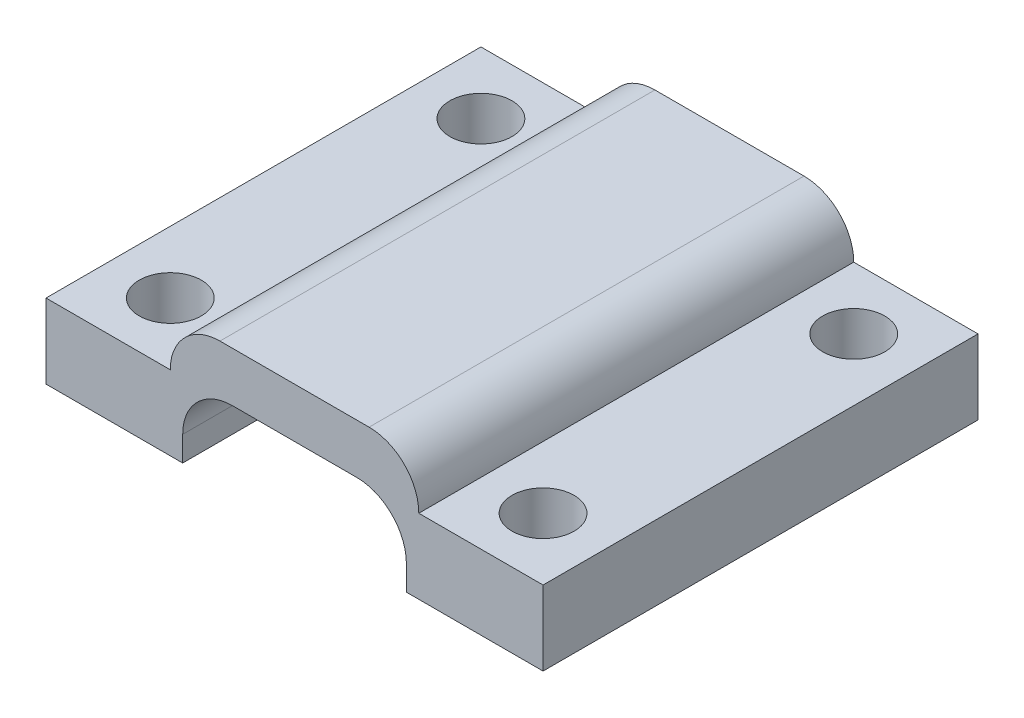
ISO-10303-21;
HEADER;
FILE_DESCRIPTION(('STEP AP214'),'2;1');
FILE_NAME('part.step','',(''),(''),'','','');
FILE_SCHEMA(('AUTOMOTIVE_DESIGN { 1 0 10303 214 1 1 1 1 }'));
ENDSEC;
DATA;
#1=APPLICATION_CONTEXT('core data for automotive mechanical design processes');
#2=APPLICATION_PROTOCOL_DEFINITION('international standard','automotive_design',2000,#1);
#3=PRODUCT_CONTEXT('',#1,'mechanical');
#4=PRODUCT('Part','Part','',(#3));
#5=PRODUCT_RELATED_PRODUCT_CATEGORY('part','',(#4));
#6=PRODUCT_DEFINITION_FORMATION('','',#4);
#7=PRODUCT_DEFINITION_CONTEXT('part definition',#1,'design');
#8=PRODUCT_DEFINITION('design','',#6,#7);
#9=PRODUCT_DEFINITION_SHAPE('','',#8);
#10=(LENGTH_UNIT() NAMED_UNIT(*) SI_UNIT(.MILLI.,.METRE.));
#11=(NAMED_UNIT(*) PLANE_ANGLE_UNIT() SI_UNIT($,.RADIAN.));
#12=(NAMED_UNIT(*) SI_UNIT($,.STERADIAN.) SOLID_ANGLE_UNIT());
#13=UNCERTAINTY_MEASURE_WITH_UNIT(LENGTH_MEASURE(1.E-05),#10,'distance_accuracy_value','');
#14=(GEOMETRIC_REPRESENTATION_CONTEXT(3) GLOBAL_UNCERTAINTY_ASSIGNED_CONTEXT((#13)) GLOBAL_UNIT_ASSIGNED_CONTEXT((#10,
#11,#12)) REPRESENTATION_CONTEXT('',''));
#15=CARTESIAN_POINT('',(0.,0.,0.));
#16=DIRECTION('',(0.,0.,1.));
#17=DIRECTION('',(1.,0.,0.));
#18=AXIS2_PLACEMENT_3D('',#15,#16,#17);
#19=CARTESIAN_POINT('',(0.,0.,0.));
#20=DIRECTION('',(0.,1.,0.));
#21=DIRECTION('',(0.,0.,1.));
#22=AXIS2_PLACEMENT_3D('',#19,#20,#21);
#23=PLANE('',#22);
#24=CARTESIAN_POINT('',(-7.21354166666667,0.,21.6145833333333));
#25=DIRECTION('',(0.,1.,0.));
#26=DIRECTION('',(0.,0.,1.));
#27=AXIS2_PLACEMENT_3D('',#24,#25,#26);
#28=CIRCLE('',#27,2.5);
#29=CARTESIAN_POINT('',(-7.21354166666667,0.,24.1145833333333));
#30=VERTEX_POINT('',#29);
#31=EDGE_CURVE('E253',#30,#30,#28,.T.);
#32=ORIENTED_EDGE('',*,*,#31,.T.);
#33=EDGE_LOOP('',(#32));
#34=FACE_BOUND('',#33,.T.);
#35=CARTESIAN_POINT('',(-7.21354166666668,0.,-3.38541666666667));
#36=DIRECTION('',(0.,1.,0.));
#37=DIRECTION('',(0.,0.,1.));
#38=AXIS2_PLACEMENT_3D('',#35,#36,#37);
#39=CIRCLE('',#38,2.5);
#40=CARTESIAN_POINT('',(-7.21354166666668,0.,-0.885416666666669));
#41=VERTEX_POINT('',#40);
#42=EDGE_CURVE('E247',#41,#41,#39,.T.);
#43=ORIENTED_EDGE('',*,*,#42,.T.);
#44=EDGE_LOOP('',(#43));
#45=FACE_BOUND('',#44,.T.);
#46=DIRECTION('',(-1.,0.,0.));
#47=VECTOR('',#46,1.);
#48=CARTESIAN_POINT('',(-12.2135416666667,0.,-8.38541666666667));
#49=LINE('',#48,#47);
#50=CARTESIAN_POINT('',(-1.21354166666667,0.,-8.38541666666667));
#51=VERTEX_POINT('',#50);
#52=CARTESIAN_POINT('',(-12.2135416666667,0.,-8.38541666666667));
#53=VERTEX_POINT('',#52);
#54=EDGE_CURVE('E139',#51,#53,#49,.T.);
#55=ORIENTED_EDGE('',*,*,#54,.F.);
#56=DIRECTION('',(0.,0.,-1.));
#57=VECTOR('',#56,1.);
#58=CARTESIAN_POINT('',(-1.21354166666668,0.,26.6145833333333));
#59=LINE('',#58,#57);
#60=CARTESIAN_POINT('',(-1.21354166666668,0.,26.6145833333333));
#61=VERTEX_POINT('',#60);
#62=EDGE_CURVE('E149',#61,#51,#59,.T.);
#63=ORIENTED_EDGE('',*,*,#62,.F.);
#64=DIRECTION('',(1.,0.,0.));
#65=VECTOR('',#64,1.);
#66=CARTESIAN_POINT('',(-12.2135416666667,0.,26.6145833333333));
#67=LINE('',#66,#65);
#68=CARTESIAN_POINT('',(-12.2135416666667,0.,26.6145833333333));
#69=VERTEX_POINT('',#68);
#70=EDGE_CURVE('E165',#69,#61,#67,.T.);
#71=ORIENTED_EDGE('',*,*,#70,.F.);
#72=DIRECTION('',(0.,0.,1.));
#73=VECTOR('',#72,1.);
#74=CARTESIAN_POINT('',(-12.2135416666667,0.,-8.38541666666667));
#75=LINE('',#74,#73);
#76=EDGE_CURVE('E159',#53,#69,#75,.T.);
#77=ORIENTED_EDGE('',*,*,#76,.F.);
#78=EDGE_LOOP('',(#55,#63,#71,#77));
#79=FACE_BOUND('',#78,.T.);
#80=ADVANCED_FACE('F33',(#34,#45,#79),#23,.F.);
#81=CARTESIAN_POINT('',(0.,6.,0.));
#82=DIRECTION('',(0.,1.,0.));
#83=DIRECTION('',(0.,0.,1.));
#84=AXIS2_PLACEMENT_3D('',#81,#82,#83);
#85=PLANE('',#84);
#86=DIRECTION('',(0.,0.,1.));
#87=VECTOR('',#86,1.);
#88=CARTESIAN_POINT('',(-2.21354166666668,6.,-8.38541666666667));
#89=LINE('',#88,#87);
#90=CARTESIAN_POINT('',(-2.21354166666667,6.,-8.38541666666667));
#91=VERTEX_POINT('',#90);
#92=CARTESIAN_POINT('',(-2.21354166666667,6.,26.6145833333333));
#93=VERTEX_POINT('',#92);
#94=EDGE_CURVE('E219',#91,#93,#89,.T.);
#95=ORIENTED_EDGE('',*,*,#94,.F.);
#96=DIRECTION('',(-1.,0.,0.));
#97=VECTOR('',#96,1.);
#98=CARTESIAN_POINT('',(-12.2135416666667,6.,-8.38541666666667));
#99=LINE('',#98,#97);
#100=CARTESIAN_POINT('',(-12.2135416666667,6.,-8.38541666666667));
#101=VERTEX_POINT('',#100);
#102=EDGE_CURVE('E260',#91,#101,#99,.T.);
#103=ORIENTED_EDGE('',*,*,#102,.T.);
#104=DIRECTION('',(0.,0.,1.));
#105=VECTOR('',#104,1.);
#106=CARTESIAN_POINT('',(-12.2135416666667,6.,-8.38541666666667));
#107=LINE('',#106,#105);
#108=CARTESIAN_POINT('',(-12.2135416666667,6.,26.6145833333333));
#109=VERTEX_POINT('',#108);
#110=EDGE_CURVE('E164',#101,#109,#107,.T.);
#111=ORIENTED_EDGE('',*,*,#110,.T.);
#112=DIRECTION('',(1.,0.,0.));
#113=VECTOR('',#112,1.);
#114=CARTESIAN_POINT('',(-12.2135416666667,6.,26.6145833333333));
#115=LINE('',#114,#113);
#116=EDGE_CURVE('E209',#109,#93,#115,.T.);
#117=ORIENTED_EDGE('',*,*,#116,.T.);
#118=EDGE_LOOP('',(#95,#103,#111,#117));
#119=FACE_BOUND('',#118,.T.);
#120=CARTESIAN_POINT('',(-7.21354166666667,6.,21.6145833333333));
#121=DIRECTION('',(0.,1.,0.));
#122=DIRECTION('',(0.,0.,1.));
#123=AXIS2_PLACEMENT_3D('',#120,#121,#122);
#124=CIRCLE('',#123,2.5);
#125=CARTESIAN_POINT('',(-7.21354166666667,6.,24.1145833333333));
#126=VERTEX_POINT('',#125);
#127=EDGE_CURVE('E237',#126,#126,#124,.T.);
#128=ORIENTED_EDGE('',*,*,#127,.F.);
#129=EDGE_LOOP('',(#128));
#130=FACE_BOUND('',#129,.T.);
#131=CARTESIAN_POINT('',(-7.21354166666668,6.,-3.38541666666667));
#132=DIRECTION('',(0.,1.,0.));
#133=DIRECTION('',(0.,0.,1.));
#134=AXIS2_PLACEMENT_3D('',#131,#132,#133);
#135=CIRCLE('',#134,2.5);
#136=CARTESIAN_POINT('',(-7.21354166666668,6.,-0.885416666666669));
#137=VERTEX_POINT('',#136);
#138=EDGE_CURVE('E250',#137,#137,#135,.T.);
#139=ORIENTED_EDGE('',*,*,#138,.F.);
#140=EDGE_LOOP('',(#139));
#141=FACE_BOUND('',#140,.T.);
#142=ADVANCED_FACE('F217',(#119,#130,#141),#85,.T.);
#143=CARTESIAN_POINT('',(-12.2135416666667,6.,-8.38541666666667));
#144=DIRECTION('',(1.,0.,0.));
#145=DIRECTION('',(0.,0.,-1.));
#146=AXIS2_PLACEMENT_3D('',#143,#144,#145);
#147=PLANE('',#146);
#148=ORIENTED_EDGE('',*,*,#76,.T.);
#149=DIRECTION('',(0.,-1.,0.));
#150=VECTOR('',#149,1.);
#151=CARTESIAN_POINT('',(-12.2135416666667,6.,26.6145833333333));
#152=LINE('',#151,#150);
#153=EDGE_CURVE('E178',#109,#69,#152,.T.);
#154=ORIENTED_EDGE('',*,*,#153,.F.);
#155=ORIENTED_EDGE('',*,*,#110,.F.);
#156=DIRECTION('',(0.,-1.,0.));
#157=VECTOR('',#156,1.);
#158=CARTESIAN_POINT('',(-12.2135416666667,6.,-8.38541666666667));
#159=LINE('',#158,#157);
#160=EDGE_CURVE('E169',#101,#53,#159,.T.);
#161=ORIENTED_EDGE('',*,*,#160,.T.);
#162=EDGE_LOOP('',(#148,#154,#155,#161));
#163=FACE_BOUND('',#162,.T.);
#164=ADVANCED_FACE('F319',(#163),#147,.F.);
#165=CARTESIAN_POINT('',(-12.2135416666667,6.,26.6145833333333));
#166=DIRECTION('',(0.,0.,-1.));
#167=DIRECTION('',(-1.,0.,0.));
#168=AXIS2_PLACEMENT_3D('',#165,#166,#167);
#169=PLANE('',#168);
#170=CARTESIAN_POINT('',(17.7864583333333,6.,26.6145833333333));
#171=VERTEX_POINT('',#170);
#172=CARTESIAN_POINT('',(27.7864583333333,6.,26.6145833333333));
#173=VERTEX_POINT('',#172);
#174=EDGE_CURVE('E223',#171,#173,#115,.T.);
#175=ORIENTED_EDGE('',*,*,#174,.F.);
#176=CARTESIAN_POINT('',(13.7864583333333,6.,26.6145833333333));
#177=DIRECTION('',(0.,0.,-1.));
#178=DIRECTION('',(-1.,0.,0.));
#179=AXIS2_PLACEMENT_3D('',#176,#177,#178);
#180=CIRCLE('',#179,4.);
#181=CARTESIAN_POINT('',(13.7864583333333,10.,26.6145833333333));
#182=VERTEX_POINT('',#181);
#183=EDGE_CURVE('E11',#171,#182,#180,.F.);
#184=ORIENTED_EDGE('',*,*,#183,.T.);
#185=DIRECTION('',(1.,0.,0.));
#186=VECTOR('',#185,1.);
#187=CARTESIAN_POINT('',(-2.21354166666667,10.,26.6145833333333));
#188=LINE('',#187,#186);
#189=CARTESIAN_POINT('',(1.78645833333333,10.,26.6145833333333));
#190=VERTEX_POINT('',#189);
#191=EDGE_CURVE('E212',#190,#182,#188,.T.);
#192=ORIENTED_EDGE('',*,*,#191,.F.);
#193=CARTESIAN_POINT('',(1.78645833333333,6.,26.6145833333333));
#194=DIRECTION('',(0.,0.,-1.));
#195=DIRECTION('',(-1.,0.,0.));
#196=AXIS2_PLACEMENT_3D('',#193,#194,#195);
#197=CIRCLE('',#196,4.);
#198=EDGE_CURVE('E41',#190,#93,#197,.F.);
#199=ORIENTED_EDGE('',*,*,#198,.T.);
#200=ORIENTED_EDGE('',*,*,#116,.F.);
#201=ORIENTED_EDGE('',*,*,#153,.T.);
#202=ORIENTED_EDGE('',*,*,#70,.T.);
#203=DIRECTION('',(0.,-1.,0.));
#204=VECTOR('',#203,1.);
#205=CARTESIAN_POINT('',(-1.21354166666668,6.,26.6145833333333));
#206=LINE('',#205,#204);
#207=CARTESIAN_POINT('',(-1.21354166666668,2.,26.6145833333333));
#208=VERTEX_POINT('',#207);
#209=EDGE_CURVE('E152',#208,#61,#206,.T.);
#210=ORIENTED_EDGE('',*,*,#209,.F.);
#211=CARTESIAN_POINT('',(2.78645833333332,2.,26.6145833333333));
#212=DIRECTION('',(0.,0.,-1.));
#213=DIRECTION('',(-1.,0.,0.));
#214=AXIS2_PLACEMENT_3D('',#211,#212,#213);
#215=CIRCLE('',#214,4.);
#216=CARTESIAN_POINT('',(2.78645833333332,6.,26.6145833333333));
#217=VERTEX_POINT('',#216);
#218=EDGE_CURVE('E196',#208,#217,#215,.T.);
#219=ORIENTED_EDGE('',*,*,#218,.T.);
#220=DIRECTION('',(-1.,0.,0.));
#221=VECTOR('',#220,1.);
#222=CARTESIAN_POINT('',(-1.21354166666668,6.,26.6145833333333));
#223=LINE('',#222,#221);
#224=CARTESIAN_POINT('',(12.7864583333333,6.,26.6145833333333));
#225=VERTEX_POINT('',#224);
#226=EDGE_CURVE('E146',#225,#217,#223,.T.);
#227=ORIENTED_EDGE('',*,*,#226,.F.);
#228=CARTESIAN_POINT('',(12.7864583333333,2.,26.6145833333333));
#229=DIRECTION('',(0.,0.,-1.));
#230=DIRECTION('',(-1.,0.,0.));
#231=AXIS2_PLACEMENT_3D('',#228,#229,#230);
#232=CIRCLE('',#231,4.);
#233=CARTESIAN_POINT('',(16.7864583333333,2.,26.6145833333333));
#234=VERTEX_POINT('',#233);
#235=EDGE_CURVE('E191',#225,#234,#232,.T.);
#236=ORIENTED_EDGE('',*,*,#235,.T.);
#237=DIRECTION('',(0.,-1.,0.));
#238=VECTOR('',#237,1.);
#239=CARTESIAN_POINT('',(16.7864583333333,6.,26.6145833333333));
#240=LINE('',#239,#238);
#241=CARTESIAN_POINT('',(16.7864583333333,0.,26.6145833333333));
#242=VERTEX_POINT('',#241);
#243=EDGE_CURVE('E228',#234,#242,#240,.T.);
#244=ORIENTED_EDGE('',*,*,#243,.T.);
#245=CARTESIAN_POINT('',(27.7864583333333,0.,26.6145833333333));
#246=VERTEX_POINT('',#245);
#247=EDGE_CURVE('E263',#242,#246,#67,.T.);
#248=ORIENTED_EDGE('',*,*,#247,.T.);
#249=DIRECTION('',(0.,-1.,0.));
#250=VECTOR('',#249,1.);
#251=CARTESIAN_POINT('',(27.7864583333333,6.,26.6145833333333));
#252=LINE('',#251,#250);
#253=EDGE_CURVE('E175',#173,#246,#252,.T.);
#254=ORIENTED_EDGE('',*,*,#253,.F.);
#255=EDGE_LOOP('',(#175,#184,#192,#199,#200,#201,#202,#210,#219,#227,#236,#244,#248,#254));
#256=FACE_BOUND('',#255,.T.);
#257=ADVANCED_FACE('F208',(#256),#169,.F.);
#258=CARTESIAN_POINT('',(27.7864583333333,6.,-8.38541666666667));
#259=DIRECTION('',(-1.,0.,0.));
#260=DIRECTION('',(0.,0.,1.));
#261=AXIS2_PLACEMENT_3D('',#258,#259,#260);
#262=PLANE('',#261);
#263=DIRECTION('',(0.,0.,-1.));
#264=VECTOR('',#263,1.);
#265=CARTESIAN_POINT('',(27.7864583333333,0.,-8.38541666666667));
#266=LINE('',#265,#264);
#267=CARTESIAN_POINT('',(27.7864583333333,0.,-8.38541666666667));
#268=VERTEX_POINT('',#267);
#269=EDGE_CURVE('E161',#246,#268,#266,.T.);
#270=ORIENTED_EDGE('',*,*,#269,.T.);
#271=DIRECTION('',(0.,-1.,0.));
#272=VECTOR('',#271,1.);
#273=CARTESIAN_POINT('',(27.7864583333333,6.,-8.38541666666667));
#274=LINE('',#273,#272);
#275=CARTESIAN_POINT('',(27.7864583333333,6.,-8.38541666666667));
#276=VERTEX_POINT('',#275);
#277=EDGE_CURVE('E171',#276,#268,#274,.T.);
#278=ORIENTED_EDGE('',*,*,#277,.F.);
#279=DIRECTION('',(0.,0.,-1.));
#280=VECTOR('',#279,1.);
#281=CARTESIAN_POINT('',(27.7864583333333,6.,-8.38541666666667));
#282=LINE('',#281,#280);
#283=EDGE_CURVE('E222',#173,#276,#282,.T.);
#284=ORIENTED_EDGE('',*,*,#283,.F.);
#285=ORIENTED_EDGE('',*,*,#253,.T.);
#286=EDGE_LOOP('',(#270,#278,#284,#285));
#287=FACE_BOUND('',#286,.T.);
#288=ADVANCED_FACE('F273',(#287),#262,.F.);
#289=CARTESIAN_POINT('',(-12.2135416666667,6.,-8.38541666666667));
#290=DIRECTION('',(0.,0.,1.));
#291=DIRECTION('',(1.,0.,0.));
#292=AXIS2_PLACEMENT_3D('',#289,#290,#291);
#293=PLANE('',#292);
#294=DIRECTION('',(-1.,0.,0.));
#295=VECTOR('',#294,1.);
#296=CARTESIAN_POINT('',(-2.21354166666668,10.,-8.38541666666667));
#297=LINE('',#296,#295);
#298=CARTESIAN_POINT('',(13.7864583333333,10.,-8.38541666666667));
#299=VERTEX_POINT('',#298);
#300=CARTESIAN_POINT('',(1.78645833333332,10.,-8.38541666666667));
#301=VERTEX_POINT('',#300);
#302=EDGE_CURVE('E231',#299,#301,#297,.T.);
#303=ORIENTED_EDGE('',*,*,#302,.F.);
#304=CARTESIAN_POINT('',(13.7864583333333,6.,-8.38541666666667));
#305=DIRECTION('',(0.,0.,1.));
#306=DIRECTION('',(1.,0.,0.));
#307=AXIS2_PLACEMENT_3D('',#304,#305,#306);
#308=CIRCLE('',#307,4.);
#309=CARTESIAN_POINT('',(17.7864583333333,6.,-8.38541666666667));
#310=VERTEX_POINT('',#309);
#311=EDGE_CURVE('E56',#299,#310,#308,.F.);
#312=ORIENTED_EDGE('',*,*,#311,.T.);
#313=EDGE_CURVE('E172',#276,#310,#99,.T.);
#314=ORIENTED_EDGE('',*,*,#313,.F.);
#315=ORIENTED_EDGE('',*,*,#277,.T.);
#316=CARTESIAN_POINT('',(16.7864583333333,0.,-8.38541666666667));
#317=VERTEX_POINT('',#316);
#318=EDGE_CURVE('E160',#268,#317,#49,.T.);
#319=ORIENTED_EDGE('',*,*,#318,.T.);
#320=DIRECTION('',(0.,-1.,0.));
#321=VECTOR('',#320,1.);
#322=CARTESIAN_POINT('',(16.7864583333333,6.,-8.38541666666667));
#323=LINE('',#322,#321);
#324=CARTESIAN_POINT('',(16.7864583333333,2.,-8.38541666666667));
#325=VERTEX_POINT('',#324);
#326=EDGE_CURVE('E145',#325,#317,#323,.T.);
#327=ORIENTED_EDGE('',*,*,#326,.F.);
#328=CARTESIAN_POINT('',(12.7864583333333,2.,-8.38541666666667));
#329=DIRECTION('',(0.,0.,1.));
#330=DIRECTION('',(1.,0.,0.));
#331=AXIS2_PLACEMENT_3D('',#328,#329,#330);
#332=CIRCLE('',#331,4.);
#333=CARTESIAN_POINT('',(12.7864583333333,6.,-8.38541666666667));
#334=VERTEX_POINT('',#333);
#335=EDGE_CURVE('E193',#325,#334,#332,.T.);
#336=ORIENTED_EDGE('',*,*,#335,.T.);
#337=DIRECTION('',(1.,0.,0.));
#338=VECTOR('',#337,1.);
#339=CARTESIAN_POINT('',(-1.21354166666667,6.,-8.38541666666667));
#340=LINE('',#339,#338);
#341=CARTESIAN_POINT('',(2.78645833333333,6.,-8.38541666666667));
#342=VERTEX_POINT('',#341);
#343=EDGE_CURVE('E290',#342,#334,#340,.T.);
#344=ORIENTED_EDGE('',*,*,#343,.F.);
#345=CARTESIAN_POINT('',(2.78645833333333,2.,-8.38541666666667));
#346=DIRECTION('',(0.,0.,1.));
#347=DIRECTION('',(1.,0.,0.));
#348=AXIS2_PLACEMENT_3D('',#345,#346,#347);
#349=CIRCLE('',#348,4.);
#350=CARTESIAN_POINT('',(-1.21354166666667,2.,-8.38541666666667));
#351=VERTEX_POINT('',#350);
#352=EDGE_CURVE('E142',#342,#351,#349,.T.);
#353=ORIENTED_EDGE('',*,*,#352,.T.);
#354=DIRECTION('',(0.,-1.,0.));
#355=VECTOR('',#354,1.);
#356=CARTESIAN_POINT('',(-1.21354166666667,6.,-8.38541666666667));
#357=LINE('',#356,#355);
#358=EDGE_CURVE('E134',#351,#51,#357,.T.);
#359=ORIENTED_EDGE('',*,*,#358,.T.);
#360=ORIENTED_EDGE('',*,*,#54,.T.);
#361=ORIENTED_EDGE('',*,*,#160,.F.);
#362=ORIENTED_EDGE('',*,*,#102,.F.);
#363=CARTESIAN_POINT('',(1.78645833333332,6.,-8.38541666666667));
#364=DIRECTION('',(0.,0.,1.));
#365=DIRECTION('',(1.,0.,0.));
#366=AXIS2_PLACEMENT_3D('',#363,#364,#365);
#367=CIRCLE('',#366,4.);
#368=EDGE_CURVE('E48',#91,#301,#367,.F.);
#369=ORIENTED_EDGE('',*,*,#368,.T.);
#370=EDGE_LOOP('',(#303,#312,#314,#315,#319,#327,#336,#344,#353,#359,#360,#361,#362,#369));
#371=FACE_BOUND('',#370,.T.);
#372=ADVANCED_FACE('F136',(#371),#293,.F.);
#373=DIRECTION('',(0.,0.,-1.));
#374=VECTOR('',#373,1.);
#375=CARTESIAN_POINT('',(17.7864583333333,6.,-8.38541666666667));
#376=LINE('',#375,#374);
#377=EDGE_CURVE('E225',#171,#310,#376,.T.);
#378=ORIENTED_EDGE('',*,*,#377,.F.);
#379=ORIENTED_EDGE('',*,*,#174,.T.);
#380=ORIENTED_EDGE('',*,*,#283,.T.);
#381=ORIENTED_EDGE('',*,*,#313,.T.);
#382=EDGE_LOOP('',(#378,#379,#380,#381));
#383=FACE_BOUND('',#382,.T.);
#384=CARTESIAN_POINT('',(22.7864583333333,6.,21.6145833333333));
#385=DIRECTION('',(0.,1.,0.));
#386=DIRECTION('',(0.,0.,1.));
#387=AXIS2_PLACEMENT_3D('',#384,#385,#386);
#388=CIRCLE('',#387,2.5);
#389=CARTESIAN_POINT('',(22.7864583333333,6.,24.1145833333333));
#390=VERTEX_POINT('',#389);
#391=EDGE_CURVE('E244',#390,#390,#388,.T.);
#392=ORIENTED_EDGE('',*,*,#391,.F.);
#393=EDGE_LOOP('',(#392));
#394=FACE_BOUND('',#393,.T.);
#395=CARTESIAN_POINT('',(22.7864583333333,6.,-3.38541666666667));
#396=DIRECTION('',(0.,1.,0.));
#397=DIRECTION('',(0.,0.,1.));
#398=AXIS2_PLACEMENT_3D('',#395,#396,#397);
#399=CIRCLE('',#398,2.5);
#400=CARTESIAN_POINT('',(22.7864583333333,6.,-0.885416666666669));
#401=VERTEX_POINT('',#400);
#402=EDGE_CURVE('E238',#401,#401,#399,.T.);
#403=ORIENTED_EDGE('',*,*,#402,.F.);
#404=EDGE_LOOP('',(#403));
#405=FACE_BOUND('',#404,.T.);
#406=ADVANCED_FACE('F281',(#383,#394,#405),#85,.T.);
#407=CARTESIAN_POINT('',(22.7864583333333,0.,21.6145833333333));
#408=DIRECTION('',(0.,1.,0.));
#409=DIRECTION('',(0.,0.,1.));
#410=AXIS2_PLACEMENT_3D('',#407,#408,#409);
#411=CIRCLE('',#410,2.5);
#412=CARTESIAN_POINT('',(22.7864583333333,0.,24.1145833333333));
#413=VERTEX_POINT('',#412);
#414=EDGE_CURVE('E241',#413,#413,#411,.T.);
#415=ORIENTED_EDGE('',*,*,#414,.T.);
#416=EDGE_LOOP('',(#415));
#417=FACE_BOUND('',#416,.T.);
#418=CARTESIAN_POINT('',(22.7864583333333,0.,-3.38541666666667));
#419=DIRECTION('',(0.,1.,0.));
#420=DIRECTION('',(0.,0.,1.));
#421=AXIS2_PLACEMENT_3D('',#418,#419,#420);
#422=CIRCLE('',#421,2.5);
#423=CARTESIAN_POINT('',(22.7864583333333,0.,-0.885416666666669));
#424=VERTEX_POINT('',#423);
#425=EDGE_CURVE('E234',#424,#424,#422,.T.);
#426=ORIENTED_EDGE('',*,*,#425,.T.);
#427=EDGE_LOOP('',(#426));
#428=FACE_BOUND('',#427,.T.);
#429=ORIENTED_EDGE('',*,*,#247,.F.);
#430=DIRECTION('',(0.,0.,1.));
#431=VECTOR('',#430,1.);
#432=CARTESIAN_POINT('',(16.7864583333333,0.,26.6145833333333));
#433=LINE('',#432,#431);
#434=EDGE_CURVE('E155',#317,#242,#433,.T.);
#435=ORIENTED_EDGE('',*,*,#434,.F.);
#436=ORIENTED_EDGE('',*,*,#318,.F.);
#437=ORIENTED_EDGE('',*,*,#269,.F.);
#438=EDGE_LOOP('',(#429,#435,#436,#437));
#439=FACE_BOUND('',#438,.T.);
#440=ADVANCED_FACE('F276',(#417,#428,#439),#23,.F.);
#441=CARTESIAN_POINT('',(-7.21354166666667,0.,21.6145833333333));
#442=DIRECTION('',(0.,1.,0.));
#443=DIRECTION('',(0.,0.,1.));
#444=AXIS2_PLACEMENT_3D('',#441,#442,#443);
#445=CYLINDRICAL_SURFACE('',#444,2.5);
#446=ORIENTED_EDGE('',*,*,#31,.F.);
#447=EDGE_LOOP('',(#446));
#448=FACE_BOUND('',#447,.T.);
#449=ORIENTED_EDGE('',*,*,#127,.T.);
#450=EDGE_LOOP('',(#449));
#451=FACE_BOUND('',#450,.T.);
#452=ADVANCED_FACE('F324',(#448,#451),#445,.F.);
#453=CARTESIAN_POINT('',(22.7864583333333,0.,-3.38541666666667));
#454=DIRECTION('',(0.,1.,0.));
#455=DIRECTION('',(0.,0.,1.));
#456=AXIS2_PLACEMENT_3D('',#453,#454,#455);
#457=CYLINDRICAL_SURFACE('',#456,2.5);
#458=ORIENTED_EDGE('',*,*,#425,.F.);
#459=EDGE_LOOP('',(#458));
#460=FACE_BOUND('',#459,.T.);
#461=ORIENTED_EDGE('',*,*,#402,.T.);
#462=EDGE_LOOP('',(#461));
#463=FACE_BOUND('',#462,.T.);
#464=ADVANCED_FACE('F330',(#460,#463),#457,.F.);
#465=CARTESIAN_POINT('',(22.7864583333333,0.,21.6145833333333));
#466=DIRECTION('',(0.,1.,0.));
#467=DIRECTION('',(0.,0.,1.));
#468=AXIS2_PLACEMENT_3D('',#465,#466,#467);
#469=CYLINDRICAL_SURFACE('',#468,2.5);
#470=ORIENTED_EDGE('',*,*,#414,.F.);
#471=EDGE_LOOP('',(#470));
#472=FACE_BOUND('',#471,.T.);
#473=ORIENTED_EDGE('',*,*,#391,.T.);
#474=EDGE_LOOP('',(#473));
#475=FACE_BOUND('',#474,.T.);
#476=ADVANCED_FACE('F339',(#472,#475),#469,.F.);
#477=CARTESIAN_POINT('',(-7.21354166666668,0.,-3.38541666666667));
#478=DIRECTION('',(0.,1.,0.));
#479=DIRECTION('',(0.,0.,1.));
#480=AXIS2_PLACEMENT_3D('',#477,#478,#479);
#481=CYLINDRICAL_SURFACE('',#480,2.5);
#482=ORIENTED_EDGE('',*,*,#42,.F.);
#483=EDGE_LOOP('',(#482));
#484=FACE_BOUND('',#483,.T.);
#485=ORIENTED_EDGE('',*,*,#138,.T.);
#486=EDGE_LOOP('',(#485));
#487=FACE_BOUND('',#486,.T.);
#488=ADVANCED_FACE('F346',(#484,#487),#481,.F.);
#489=CARTESIAN_POINT('',(0.,10.,0.));
#490=DIRECTION('',(0.,1.,0.));
#491=DIRECTION('',(0.,0.,1.));
#492=AXIS2_PLACEMENT_3D('',#489,#490,#491);
#493=PLANE('',#492);
#494=ORIENTED_EDGE('',*,*,#191,.T.);
#495=DIRECTION('',(0.,0.,-1.));
#496=VECTOR('',#495,1.);
#497=CARTESIAN_POINT('',(13.7864583333333,10.,-8.38541666666667));
#498=LINE('',#497,#496);
#499=EDGE_CURVE('E201',#182,#299,#498,.T.);
#500=ORIENTED_EDGE('',*,*,#499,.T.);
#501=ORIENTED_EDGE('',*,*,#302,.T.);
#502=DIRECTION('',(0.,0.,1.));
#503=VECTOR('',#502,1.);
#504=CARTESIAN_POINT('',(1.78645833333333,10.,26.6145833333333));
#505=LINE('',#504,#503);
#506=EDGE_CURVE('E198',#301,#190,#505,.T.);
#507=ORIENTED_EDGE('',*,*,#506,.T.);
#508=EDGE_LOOP('',(#494,#500,#501,#507));
#509=FACE_BOUND('',#508,.T.);
#510=ADVANCED_FACE('F286',(#509),#493,.T.);
#511=CARTESIAN_POINT('',(-1.21354166666668,6.,26.6145833333333));
#512=DIRECTION('',(-1.,0.,0.));
#513=DIRECTION('',(0.,0.,1.));
#514=AXIS2_PLACEMENT_3D('',#511,#512,#513);
#515=PLANE('',#514);
#516=ORIENTED_EDGE('',*,*,#358,.F.);
#517=DIRECTION('',(0.,0.,-1.));
#518=VECTOR('',#517,1.);
#519=CARTESIAN_POINT('',(-1.21354166666668,2.,26.6145833333333));
#520=LINE('',#519,#518);
#521=EDGE_CURVE('E189',#351,#208,#520,.F.);
#522=ORIENTED_EDGE('',*,*,#521,.T.);
#523=ORIENTED_EDGE('',*,*,#209,.T.);
#524=ORIENTED_EDGE('',*,*,#62,.T.);
#525=EDGE_LOOP('',(#516,#522,#523,#524));
#526=FACE_BOUND('',#525,.T.);
#527=ADVANCED_FACE('F150',(#526),#515,.F.);
#528=CARTESIAN_POINT('',(16.7864583333333,6.,26.6145833333333));
#529=DIRECTION('',(1.,0.,0.));
#530=DIRECTION('',(0.,0.,-1.));
#531=AXIS2_PLACEMENT_3D('',#528,#529,#530);
#532=PLANE('',#531);
#533=ORIENTED_EDGE('',*,*,#243,.F.);
#534=DIRECTION('',(0.,0.,1.));
#535=VECTOR('',#534,1.);
#536=CARTESIAN_POINT('',(16.7864583333333,2.,26.6145833333333));
#537=LINE('',#536,#535);
#538=EDGE_CURVE('E187',#234,#325,#537,.F.);
#539=ORIENTED_EDGE('',*,*,#538,.T.);
#540=ORIENTED_EDGE('',*,*,#326,.T.);
#541=ORIENTED_EDGE('',*,*,#434,.T.);
#542=EDGE_LOOP('',(#533,#539,#540,#541));
#543=FACE_BOUND('',#542,.T.);
#544=ADVANCED_FACE('F304',(#543),#532,.F.);
#545=CARTESIAN_POINT('',(0.,6.,0.));
#546=DIRECTION('',(0.,-1.,0.));
#547=DIRECTION('',(0.,0.,-1.));
#548=AXIS2_PLACEMENT_3D('',#545,#546,#547);
#549=PLANE('',#548);
#550=ORIENTED_EDGE('',*,*,#343,.T.);
#551=DIRECTION('',(0.,0.,1.));
#552=VECTOR('',#551,1.);
#553=CARTESIAN_POINT('',(12.7864583333333,6.,0.));
#554=LINE('',#553,#552);
#555=EDGE_CURVE('E184',#334,#225,#554,.T.);
#556=ORIENTED_EDGE('',*,*,#555,.T.);
#557=ORIENTED_EDGE('',*,*,#226,.T.);
#558=DIRECTION('',(0.,0.,-1.));
#559=VECTOR('',#558,1.);
#560=CARTESIAN_POINT('',(2.78645833333333,6.,0.));
#561=LINE('',#560,#559);
#562=EDGE_CURVE('E181',#217,#342,#561,.T.);
#563=ORIENTED_EDGE('',*,*,#562,.T.);
#564=EDGE_LOOP('',(#550,#556,#557,#563));
#565=FACE_BOUND('',#564,.T.);
#566=ADVANCED_FACE('F297',(#565),#549,.T.);
#567=CARTESIAN_POINT('',(12.7864583333333,2.,0.));
#568=DIRECTION('',(0.,0.,1.));
#569=DIRECTION('',(1.,0.,0.));
#570=AXIS2_PLACEMENT_3D('',#567,#568,#569);
#571=CYLINDRICAL_SURFACE('',#570,4.);
#572=ORIENTED_EDGE('',*,*,#335,.F.);
#573=ORIENTED_EDGE('',*,*,#538,.F.);
#574=ORIENTED_EDGE('',*,*,#235,.F.);
#575=ORIENTED_EDGE('',*,*,#555,.F.);
#576=EDGE_LOOP('',(#572,#573,#574,#575));
#577=FACE_BOUND('',#576,.T.);
#578=ADVANCED_FACE('F301',(#577),#571,.F.);
#579=CARTESIAN_POINT('',(2.78645833333333,2.,0.));
#580=DIRECTION('',(0.,0.,-1.));
#581=DIRECTION('',(-1.,0.,0.));
#582=AXIS2_PLACEMENT_3D('',#579,#580,#581);
#583=CYLINDRICAL_SURFACE('',#582,4.);
#584=ORIENTED_EDGE('',*,*,#218,.F.);
#585=ORIENTED_EDGE('',*,*,#521,.F.);
#586=ORIENTED_EDGE('',*,*,#352,.F.);
#587=ORIENTED_EDGE('',*,*,#562,.F.);
#588=EDGE_LOOP('',(#584,#585,#586,#587));
#589=FACE_BOUND('',#588,.T.);
#590=ADVANCED_FACE('F390',(#589),#583,.F.);
#591=CARTESIAN_POINT('',(13.7864583333333,6.,0.));
#592=DIRECTION('',(0.,0.,1.));
#593=DIRECTION('',(1.,0.,0.));
#594=AXIS2_PLACEMENT_3D('',#591,#592,#593);
#595=CYLINDRICAL_SURFACE('',#594,4.);
#596=ORIENTED_EDGE('',*,*,#183,.F.);
#597=ORIENTED_EDGE('',*,*,#377,.T.);
#598=ORIENTED_EDGE('',*,*,#311,.F.);
#599=ORIENTED_EDGE('',*,*,#499,.F.);
#600=EDGE_LOOP('',(#596,#597,#598,#599));
#601=FACE_BOUND('',#600,.T.);
#602=ADVANCED_FACE('F284',(#601),#595,.T.);
#603=CARTESIAN_POINT('',(1.78645833333333,6.,0.));
#604=DIRECTION('',(0.,0.,-1.));
#605=DIRECTION('',(-1.,0.,0.));
#606=AXIS2_PLACEMENT_3D('',#603,#604,#605);
#607=CYLINDRICAL_SURFACE('',#606,4.);
#608=ORIENTED_EDGE('',*,*,#368,.F.);
#609=ORIENTED_EDGE('',*,*,#94,.T.);
#610=ORIENTED_EDGE('',*,*,#198,.F.);
#611=ORIENTED_EDGE('',*,*,#506,.F.);
#612=EDGE_LOOP('',(#608,#609,#610,#611));
#613=FACE_BOUND('',#612,.T.);
#614=ADVANCED_FACE('F35',(#613),#607,.T.);
#615=CLOSED_SHELL('',(#80,#142,#164,#257,#288,#372,#406,#440,#452,#464,#476,#488,#510,#527,#544,
#566,#578,#590,#602,#614));
#616=MANIFOLD_SOLID_BREP('B2',#615);
#617=ADVANCED_BREP_SHAPE_REPRESENTATION('',(#18,#616),#14);
#618=SHAPE_DEFINITION_REPRESENTATION(#9,#617);
ENDSEC;
END-ISO-10303-21;
